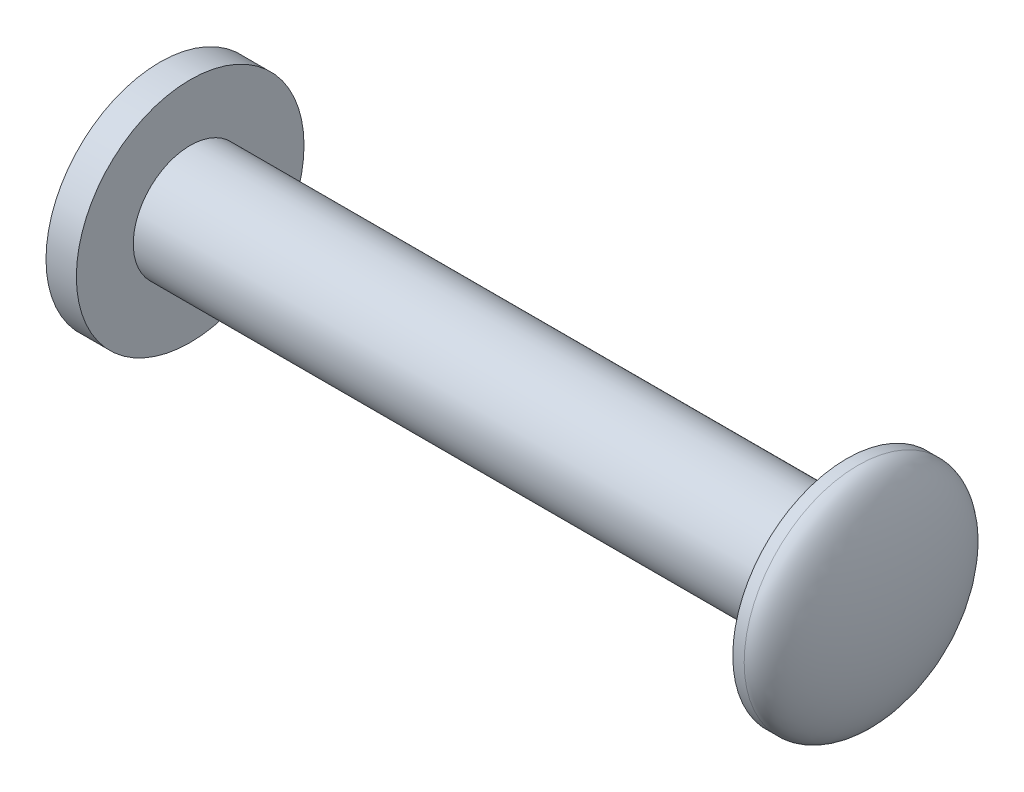
ISO-10303-21;
HEADER;
FILE_DESCRIPTION(('STEP AP214'),'2;1');
FILE_NAME('part.step','',(''),(''),'','','');
FILE_SCHEMA(('AUTOMOTIVE_DESIGN { 1 0 10303 214 1 1 1 1 }'));
ENDSEC;
DATA;
#1=APPLICATION_CONTEXT('core data for automotive mechanical design processes');
#2=APPLICATION_PROTOCOL_DEFINITION('international standard','automotive_design',2000,#1);
#3=PRODUCT_CONTEXT('',#1,'mechanical');
#4=PRODUCT('Part','Part','',(#3));
#5=PRODUCT_RELATED_PRODUCT_CATEGORY('part','',(#4));
#6=PRODUCT_DEFINITION_FORMATION('','',#4);
#7=PRODUCT_DEFINITION_CONTEXT('part definition',#1,'design');
#8=PRODUCT_DEFINITION('design','',#6,#7);
#9=PRODUCT_DEFINITION_SHAPE('','',#8);
#10=(LENGTH_UNIT() NAMED_UNIT(*) SI_UNIT(.MILLI.,.METRE.));
#11=(NAMED_UNIT(*) PLANE_ANGLE_UNIT() SI_UNIT($,.RADIAN.));
#12=(NAMED_UNIT(*) SI_UNIT($,.STERADIAN.) SOLID_ANGLE_UNIT());
#13=UNCERTAINTY_MEASURE_WITH_UNIT(LENGTH_MEASURE(1.E-05),#10,'distance_accuracy_value','');
#14=(GEOMETRIC_REPRESENTATION_CONTEXT(3) GLOBAL_UNCERTAINTY_ASSIGNED_CONTEXT((#13)) GLOBAL_UNIT_ASSIGNED_CONTEXT((#10,
#11,#12)) REPRESENTATION_CONTEXT('',''));
#15=CARTESIAN_POINT('',(0.,0.,0.));
#16=DIRECTION('',(0.,0.,1.));
#17=DIRECTION('',(1.,0.,0.));
#18=AXIS2_PLACEMENT_3D('',#15,#16,#17);
#19=CARTESIAN_POINT('',(0.8,0.,0.));
#20=DIRECTION('',(-1.,0.,0.));
#21=DIRECTION('',(0.,0.,1.));
#22=AXIS2_PLACEMENT_3D('',#19,#20,#21);
#23=CYLINDRICAL_SURFACE('',#22,3.);
#24=CARTESIAN_POINT('',(0.8,0.,0.));
#25=DIRECTION('',(1.,0.,0.));
#26=DIRECTION('',(0.,0.,-1.));
#27=AXIS2_PLACEMENT_3D('',#24,#25,#26);
#28=CIRCLE('',#27,3.);
#29=CARTESIAN_POINT('',(0.8,0.,-3.));
#30=VERTEX_POINT('',#29);
#31=EDGE_CURVE('E11',#30,#30,#28,.T.);
#32=ORIENTED_EDGE('',*,*,#31,.F.);
#33=EDGE_LOOP('',(#32));
#34=FACE_BOUND('',#33,.T.);
#35=CARTESIAN_POINT('',(0.,0.,0.));
#36=DIRECTION('',(1.,0.,0.));
#37=DIRECTION('',(0.,0.,-1.));
#38=AXIS2_PLACEMENT_3D('',#35,#36,#37);
#39=CIRCLE('',#38,3.);
#40=CARTESIAN_POINT('',(0.,0.,-3.));
#41=VERTEX_POINT('',#40);
#42=EDGE_CURVE('E42',#41,#41,#39,.T.);
#43=ORIENTED_EDGE('',*,*,#42,.T.);
#44=EDGE_LOOP('',(#43));
#45=FACE_BOUND('',#44,.T.);
#46=ADVANCED_FACE('F34',(#34,#45),#23,.T.);
#47=CARTESIAN_POINT('',(0.8,0.,0.));
#48=DIRECTION('',(1.,0.,0.));
#49=DIRECTION('',(0.,0.,-1.));
#50=AXIS2_PLACEMENT_3D('',#47,#48,#49);
#51=PLANE('',#50);
#52=CARTESIAN_POINT('',(0.8,0.,0.));
#53=DIRECTION('',(1.,0.,0.));
#54=DIRECTION('',(0.,0.,-1.));
#55=AXIS2_PLACEMENT_3D('',#52,#53,#54);
#56=CIRCLE('',#55,1.5);
#57=CARTESIAN_POINT('',(0.8,0.,-1.5));
#58=VERTEX_POINT('',#57);
#59=EDGE_CURVE('E54',#58,#58,#56,.T.);
#60=ORIENTED_EDGE('',*,*,#59,.F.);
#61=EDGE_LOOP('',(#60));
#62=FACE_BOUND('',#61,.T.);
#63=ORIENTED_EDGE('',*,*,#31,.T.);
#64=EDGE_LOOP('',(#63));
#65=FACE_BOUND('',#64,.T.);
#66=ADVANCED_FACE('F76',(#62,#65),#51,.T.);
#67=CARTESIAN_POINT('',(0.,0.,0.));
#68=DIRECTION('',(1.,0.,0.));
#69=DIRECTION('',(0.,0.,-1.));
#70=AXIS2_PLACEMENT_3D('',#67,#68,#69);
#71=PLANE('',#70);
#72=ORIENTED_EDGE('',*,*,#42,.F.);
#73=EDGE_LOOP('',(#72));
#74=FACE_BOUND('',#73,.T.);
#75=ADVANCED_FACE('F72',(#74),#71,.F.);
#76=CARTESIAN_POINT('',(18.1,0.,0.));
#77=DIRECTION('',(-1.,0.,0.));
#78=DIRECTION('',(0.,0.,1.));
#79=AXIS2_PLACEMENT_3D('',#76,#77,#78);
#80=CYLINDRICAL_SURFACE('',#79,1.5);
#81=CARTESIAN_POINT('',(18.1,0.,0.));
#82=DIRECTION('',(1.,0.,0.));
#83=DIRECTION('',(0.,0.,-1.));
#84=AXIS2_PLACEMENT_3D('',#81,#82,#83);
#85=CIRCLE('',#84,1.5);
#86=CARTESIAN_POINT('',(18.1,0.,-1.5));
#87=VERTEX_POINT('',#86);
#88=EDGE_CURVE('E57',#87,#87,#85,.T.);
#89=ORIENTED_EDGE('',*,*,#88,.F.);
#90=EDGE_LOOP('',(#89));
#91=FACE_BOUND('',#90,.T.);
#92=ORIENTED_EDGE('',*,*,#59,.T.);
#93=EDGE_LOOP('',(#92));
#94=FACE_BOUND('',#93,.T.);
#95=ADVANCED_FACE('F69',(#91,#94),#80,.T.);
#96=CARTESIAN_POINT('',(18.4,0.,0.));
#97=DIRECTION('',(-1.,0.,0.));
#98=DIRECTION('',(0.,0.,1.));
#99=AXIS2_PLACEMENT_3D('',#96,#97,#98);
#100=CYLINDRICAL_SURFACE('',#99,3.);
#101=CARTESIAN_POINT('',(18.4,0.,0.));
#102=DIRECTION('',(1.,0.,0.));
#103=DIRECTION('',(0.,0.,-1.));
#104=AXIS2_PLACEMENT_3D('',#101,#102,#103);
#105=CIRCLE('',#104,3.);
#106=CARTESIAN_POINT('',(18.4,0.,-3.));
#107=VERTEX_POINT('',#106);
#108=EDGE_CURVE('E52',#107,#107,#105,.T.);
#109=ORIENTED_EDGE('',*,*,#108,.F.);
#110=EDGE_LOOP('',(#109));
#111=FACE_BOUND('',#110,.T.);
#112=CARTESIAN_POINT('',(18.1,0.,0.));
#113=DIRECTION('',(1.,0.,0.));
#114=DIRECTION('',(0.,0.,-1.));
#115=AXIS2_PLACEMENT_3D('',#112,#113,#114);
#116=CIRCLE('',#115,3.);
#117=CARTESIAN_POINT('',(18.1,0.,-3.));
#118=VERTEX_POINT('',#117);
#119=EDGE_CURVE('E55',#118,#118,#116,.T.);
#120=ORIENTED_EDGE('',*,*,#119,.T.);
#121=EDGE_LOOP('',(#120));
#122=FACE_BOUND('',#121,.T.);
#123=ADVANCED_FACE('F49',(#111,#122),#100,.T.);
#124=CARTESIAN_POINT('',(18.4,0.,0.));
#125=DIRECTION('',(0.,1.,0.));
#126=DIRECTION('',(0.,0.,-1.));
#127=AXIS2_PLACEMENT_3D('',#124,#125,#126);
#128=ELLIPSE('',#127,3.,1.);
#129=TRIMMED_CURVE('',#128,(PARAMETER_VALUE(4.71238898038469)),
(PARAMETER_VALUE(7.85398163397448)),.T.,.PARAMETER.);
#130=CARTESIAN_POINT('',(17.4,0.,0.));
#131=DIRECTION('',(1.,0.,0.));
#132=AXIS1_PLACEMENT('',#130,#131);
#133=SURFACE_OF_REVOLUTION('',#129,#132);
#134=CARTESIAN_POINT('',(19.4,0.,0.));
#135=VERTEX_POINT('',#134);
#136=VERTEX_LOOP('',#135);
#137=FACE_BOUND('',#136,.T.);
#138=ORIENTED_EDGE('',*,*,#108,.T.);
#139=EDGE_LOOP('',(#138));
#140=FACE_BOUND('',#139,.T.);
#141=ADVANCED_FACE('F36',(#137,#140),#133,.F.);
#142=CARTESIAN_POINT('',(18.1,0.,0.));
#143=DIRECTION('',(1.,0.,0.));
#144=DIRECTION('',(0.,0.,-1.));
#145=AXIS2_PLACEMENT_3D('',#142,#143,#144);
#146=PLANE('',#145);
#147=ORIENTED_EDGE('',*,*,#88,.T.);
#148=EDGE_LOOP('',(#147));
#149=FACE_BOUND('',#148,.T.);
#150=ORIENTED_EDGE('',*,*,#119,.F.);
#151=EDGE_LOOP('',(#150));
#152=FACE_BOUND('',#151,.T.);
#153=ADVANCED_FACE('F48',(#149,#152),#146,.F.);
#154=CLOSED_SHELL('',(#46,#66,#75,#95,#123,#141,#153));
#155=MANIFOLD_SOLID_BREP('B2',#154);
#156=ADVANCED_BREP_SHAPE_REPRESENTATION('',(#18,#155),#14);
#157=SHAPE_DEFINITION_REPRESENTATION(#9,#156);
ENDSEC;
END-ISO-10303-21;
